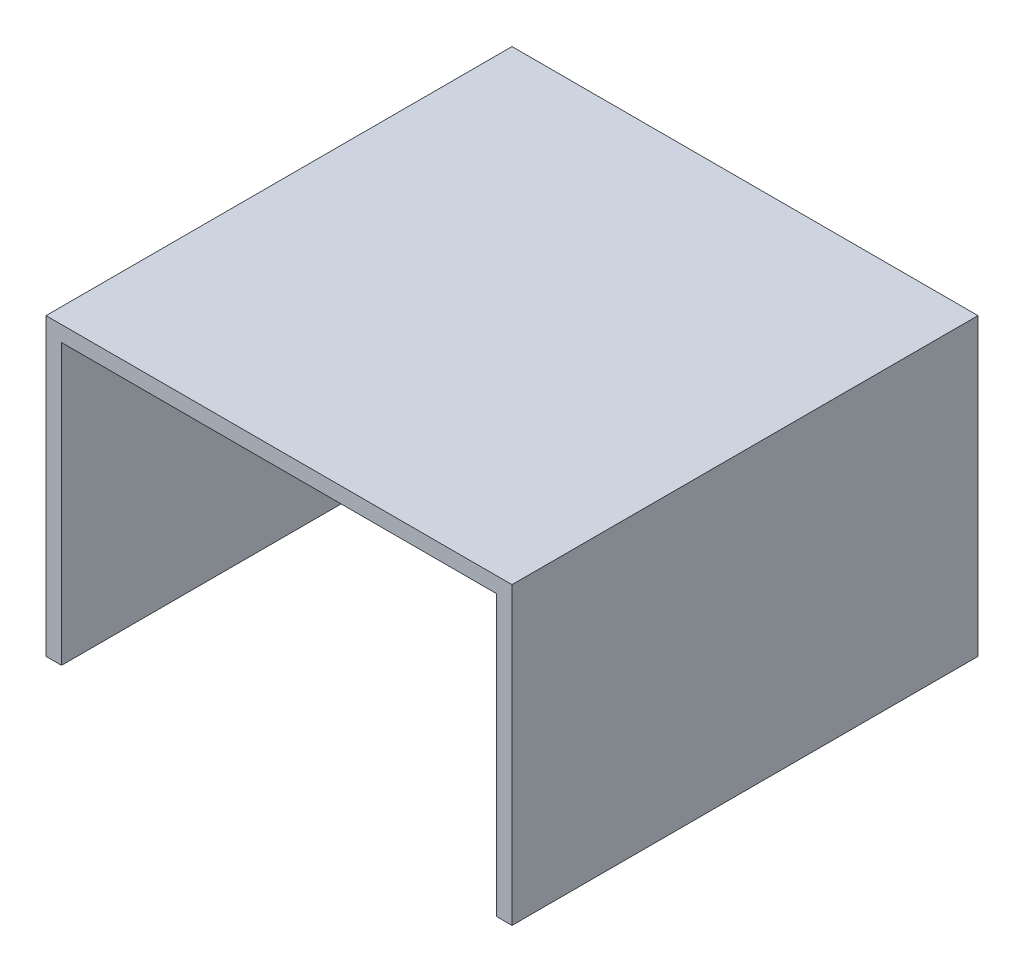
ISO-10303-21;
HEADER;
FILE_DESCRIPTION(('STEP AP214'),'2;1');
FILE_NAME('part.step','',(''),(''),'','','');
FILE_SCHEMA(('AUTOMOTIVE_DESIGN { 1 0 10303 214 1 1 1 1 }'));
ENDSEC;
DATA;
#1=APPLICATION_CONTEXT('core data for automotive mechanical design processes');
#2=APPLICATION_PROTOCOL_DEFINITION('international standard','automotive_design',2000,#1);
#3=PRODUCT_CONTEXT('',#1,'mechanical');
#4=PRODUCT('Part','Part','',(#3));
#5=PRODUCT_RELATED_PRODUCT_CATEGORY('part','',(#4));
#6=PRODUCT_DEFINITION_FORMATION('','',#4);
#7=PRODUCT_DEFINITION_CONTEXT('part definition',#1,'design');
#8=PRODUCT_DEFINITION('design','',#6,#7);
#9=PRODUCT_DEFINITION_SHAPE('','',#8);
#10=(LENGTH_UNIT() NAMED_UNIT(*) SI_UNIT(.MILLI.,.METRE.));
#11=(NAMED_UNIT(*) PLANE_ANGLE_UNIT() SI_UNIT($,.RADIAN.));
#12=(NAMED_UNIT(*) SI_UNIT($,.STERADIAN.) SOLID_ANGLE_UNIT());
#13=UNCERTAINTY_MEASURE_WITH_UNIT(LENGTH_MEASURE(1.E-05),#10,'distance_accuracy_value','');
#14=(GEOMETRIC_REPRESENTATION_CONTEXT(3) GLOBAL_UNCERTAINTY_ASSIGNED_CONTEXT((#13)) GLOBAL_UNIT_ASSIGNED_CONTEXT((#10,
#11,#12)) REPRESENTATION_CONTEXT('',''));
#15=CARTESIAN_POINT('',(0.,0.,0.));
#16=DIRECTION('',(0.,0.,1.));
#17=DIRECTION('',(1.,0.,0.));
#18=AXIS2_PLACEMENT_3D('',#15,#16,#17);
#19=CARTESIAN_POINT('',(0.,0.,0.));
#20=DIRECTION('',(0.,1.,0.));
#21=DIRECTION('',(0.,0.,1.));
#22=AXIS2_PLACEMENT_3D('',#19,#20,#21);
#23=PLANE('',#22);
#24=DIRECTION('',(0.,0.,1.));
#25=VECTOR('',#24,1.);
#26=CARTESIAN_POINT('',(-23.028710668016,0.,46.3302752293578));
#27=LINE('',#26,#25);
#28=CARTESIAN_POINT('',(-23.028710668016,0.,-13.6697247706422));
#29=VERTEX_POINT('',#28);
#30=CARTESIAN_POINT('',(-23.028710668016,0.,46.3302752293578));
#31=VERTEX_POINT('',#30);
#32=EDGE_CURVE('E132',#29,#31,#27,.T.);
#33=ORIENTED_EDGE('',*,*,#32,.F.);
#34=DIRECTION('',(-1.,0.,0.));
#35=VECTOR('',#34,1.);
#36=CARTESIAN_POINT('',(-25.028710668016,0.,-13.6697247706422));
#37=LINE('',#36,#35);
#38=CARTESIAN_POINT('',(32.971289331984,0.,-13.6697247706422));
#39=VERTEX_POINT('',#38);
#40=EDGE_CURVE('E175',#39,#29,#37,.T.);
#41=ORIENTED_EDGE('',*,*,#40,.F.);
#42=DIRECTION('',(0.,0.,-1.));
#43=VECTOR('',#42,1.);
#44=CARTESIAN_POINT('',(32.971289331984,0.,46.3302752293578));
#45=LINE('',#44,#43);
#46=CARTESIAN_POINT('',(32.971289331984,0.,46.3302752293578));
#47=VERTEX_POINT('',#46);
#48=EDGE_CURVE('E146',#47,#39,#45,.T.);
#49=ORIENTED_EDGE('',*,*,#48,.F.);
#50=DIRECTION('',(1.,0.,0.));
#51=VECTOR('',#50,1.);
#52=CARTESIAN_POINT('',(-25.028710668016,0.,46.3302752293578));
#53=LINE('',#52,#51);
#54=EDGE_CURVE('E55',#31,#47,#53,.T.);
#55=ORIENTED_EDGE('',*,*,#54,.F.);
#56=EDGE_LOOP('',(#33,#41,#49,#55));
#57=FACE_BOUND('',#56,.T.);
#58=ADVANCED_FACE('F39',(#57),#23,.F.);
#59=CARTESIAN_POINT('',(-25.028710668016,2.,-13.6697247706422));
#60=DIRECTION('',(1.,0.,0.));
#61=DIRECTION('',(0.,0.,-1.));
#62=AXIS2_PLACEMENT_3D('',#59,#60,#61);
#63=PLANE('',#62);
#64=DIRECTION('',(0.,-1.,0.));
#65=VECTOR('',#64,1.);
#66=CARTESIAN_POINT('',(-25.028710668016,2.,-13.6697247706422));
#67=LINE('',#66,#65);
#68=CARTESIAN_POINT('',(-25.028710668016,2.,-13.6697247706422));
#69=VERTEX_POINT('',#68);
#70=CARTESIAN_POINT('',(-25.028710668016,-36.,-13.6697247706422));
#71=VERTEX_POINT('',#70);
#72=EDGE_CURVE('E107',#69,#71,#67,.T.);
#73=ORIENTED_EDGE('',*,*,#72,.T.);
#74=DIRECTION('',(0.,0.,-1.));
#75=VECTOR('',#74,1.);
#76=CARTESIAN_POINT('',(-25.028710668016,-36.,46.3302752293578));
#77=LINE('',#76,#75);
#78=CARTESIAN_POINT('',(-25.028710668016,-36.,46.3302752293578));
#79=VERTEX_POINT('',#78);
#80=EDGE_CURVE('E111',#79,#71,#77,.T.);
#81=ORIENTED_EDGE('',*,*,#80,.F.);
#82=DIRECTION('',(0.,-1.,0.));
#83=VECTOR('',#82,1.);
#84=CARTESIAN_POINT('',(-25.028710668016,2.,46.3302752293578));
#85=LINE('',#84,#83);
#86=CARTESIAN_POINT('',(-25.028710668016,2.,46.3302752293578));
#87=VERTEX_POINT('',#86);
#88=EDGE_CURVE('E11',#87,#79,#85,.T.);
#89=ORIENTED_EDGE('',*,*,#88,.F.);
#90=DIRECTION('',(0.,0.,1.));
#91=VECTOR('',#90,1.);
#92=CARTESIAN_POINT('',(-25.028710668016,2.,-13.6697247706422));
#93=LINE('',#92,#91);
#94=EDGE_CURVE('E112',#69,#87,#93,.T.);
#95=ORIENTED_EDGE('',*,*,#94,.F.);
#96=EDGE_LOOP('',(#73,#81,#89,#95));
#97=FACE_BOUND('',#96,.T.);
#98=ADVANCED_FACE('F41',(#97),#63,.F.);
#99=CARTESIAN_POINT('',(-25.028710668016,2.,46.3302752293578));
#100=DIRECTION('',(0.,0.,-1.));
#101=DIRECTION('',(-1.,0.,0.));
#102=AXIS2_PLACEMENT_3D('',#99,#100,#101);
#103=PLANE('',#102);
#104=ORIENTED_EDGE('',*,*,#88,.T.);
#105=DIRECTION('',(-1.,0.,0.));
#106=VECTOR('',#105,1.);
#107=CARTESIAN_POINT('',(-25.028710668016,-36.,46.3302752293578));
#108=LINE('',#107,#106);
#109=CARTESIAN_POINT('',(-23.028710668016,-36.,46.3302752293578));
#110=VERTEX_POINT('',#109);
#111=EDGE_CURVE('E130',#110,#79,#108,.T.);
#112=ORIENTED_EDGE('',*,*,#111,.F.);
#113=DIRECTION('',(0.,1.,0.));
#114=VECTOR('',#113,1.);
#115=CARTESIAN_POINT('',(-23.028710668016,-36.,46.3302752293578));
#116=LINE('',#115,#114);
#117=EDGE_CURVE('E140',#110,#31,#116,.T.);
#118=ORIENTED_EDGE('',*,*,#117,.T.);
#119=ORIENTED_EDGE('',*,*,#54,.T.);
#120=DIRECTION('',(0.,1.,0.));
#121=VECTOR('',#120,1.);
#122=CARTESIAN_POINT('',(32.971289331984,-36.,46.3302752293578));
#123=LINE('',#122,#121);
#124=CARTESIAN_POINT('',(32.971289331984,-36.,46.3302752293578));
#125=VERTEX_POINT('',#124);
#126=EDGE_CURVE('E168',#125,#47,#123,.T.);
#127=ORIENTED_EDGE('',*,*,#126,.F.);
#128=DIRECTION('',(-1.,0.,0.));
#129=VECTOR('',#128,1.);
#130=CARTESIAN_POINT('',(34.971289331984,-36.,46.3302752293578));
#131=LINE('',#130,#129);
#132=CARTESIAN_POINT('',(34.971289331984,-36.,46.3302752293578));
#133=VERTEX_POINT('',#132);
#134=EDGE_CURVE('E151',#133,#125,#131,.T.);
#135=ORIENTED_EDGE('',*,*,#134,.F.);
#136=DIRECTION('',(0.,-1.,0.));
#137=VECTOR('',#136,1.);
#138=CARTESIAN_POINT('',(34.971289331984,2.,46.3302752293578));
#139=LINE('',#138,#137);
#140=CARTESIAN_POINT('',(34.971289331984,2.,46.3302752293578));
#141=VERTEX_POINT('',#140);
#142=EDGE_CURVE('E48',#141,#133,#139,.T.);
#143=ORIENTED_EDGE('',*,*,#142,.F.);
#144=DIRECTION('',(1.,0.,0.));
#145=VECTOR('',#144,1.);
#146=CARTESIAN_POINT('',(-25.028710668016,2.,46.3302752293578));
#147=LINE('',#146,#145);
#148=EDGE_CURVE('E174',#87,#141,#147,.T.);
#149=ORIENTED_EDGE('',*,*,#148,.F.);
#150=EDGE_LOOP('',(#104,#112,#118,#119,#127,#135,#143,#149));
#151=FACE_BOUND('',#150,.T.);
#152=ADVANCED_FACE('F196',(#151),#103,.F.);
#153=CARTESIAN_POINT('',(34.971289331984,2.,-13.6697247706422));
#154=DIRECTION('',(-1.,0.,0.));
#155=DIRECTION('',(0.,0.,1.));
#156=AXIS2_PLACEMENT_3D('',#153,#154,#155);
#157=PLANE('',#156);
#158=ORIENTED_EDGE('',*,*,#142,.T.);
#159=DIRECTION('',(0.,0.,1.));
#160=VECTOR('',#159,1.);
#161=CARTESIAN_POINT('',(34.971289331984,-36.,46.3302752293578));
#162=LINE('',#161,#160);
#163=CARTESIAN_POINT('',(34.971289331984,-36.,-13.6697247706422));
#164=VERTEX_POINT('',#163);
#165=EDGE_CURVE('E147',#164,#133,#162,.T.);
#166=ORIENTED_EDGE('',*,*,#165,.F.);
#167=DIRECTION('',(0.,-1.,0.));
#168=VECTOR('',#167,1.);
#169=CARTESIAN_POINT('',(34.971289331984,2.,-13.6697247706422));
#170=LINE('',#169,#168);
#171=CARTESIAN_POINT('',(34.971289331984,2.,-13.6697247706422));
#172=VERTEX_POINT('',#171);
#173=EDGE_CURVE('E115',#172,#164,#170,.T.);
#174=ORIENTED_EDGE('',*,*,#173,.F.);
#175=DIRECTION('',(0.,0.,-1.));
#176=VECTOR('',#175,1.);
#177=CARTESIAN_POINT('',(34.971289331984,2.,-13.6697247706422));
#178=LINE('',#177,#176);
#179=EDGE_CURVE('E178',#141,#172,#178,.T.);
#180=ORIENTED_EDGE('',*,*,#179,.F.);
#181=EDGE_LOOP('',(#158,#166,#174,#180));
#182=FACE_BOUND('',#181,.T.);
#183=ADVANCED_FACE('F194',(#182),#157,.F.);
#184=CARTESIAN_POINT('',(-25.028710668016,2.,-13.6697247706422));
#185=DIRECTION('',(0.,0.,1.));
#186=DIRECTION('',(1.,0.,0.));
#187=AXIS2_PLACEMENT_3D('',#184,#185,#186);
#188=PLANE('',#187);
#189=ORIENTED_EDGE('',*,*,#173,.T.);
#190=DIRECTION('',(1.,0.,0.));
#191=VECTOR('',#190,1.);
#192=CARTESIAN_POINT('',(34.971289331984,-36.,-13.6697247706422));
#193=LINE('',#192,#191);
#194=CARTESIAN_POINT('',(32.971289331984,-36.,-13.6697247706422));
#195=VERTEX_POINT('',#194);
#196=EDGE_CURVE('E157',#195,#164,#193,.T.);
#197=ORIENTED_EDGE('',*,*,#196,.F.);
#198=DIRECTION('',(0.,1.,0.));
#199=VECTOR('',#198,1.);
#200=CARTESIAN_POINT('',(32.971289331984,-36.,-13.6697247706422));
#201=LINE('',#200,#199);
#202=EDGE_CURVE('E161',#195,#39,#201,.T.);
#203=ORIENTED_EDGE('',*,*,#202,.T.);
#204=ORIENTED_EDGE('',*,*,#40,.T.);
#205=DIRECTION('',(0.,1.,0.));
#206=VECTOR('',#205,1.);
#207=CARTESIAN_POINT('',(-23.028710668016,-36.,-13.6697247706422));
#208=LINE('',#207,#206);
#209=CARTESIAN_POINT('',(-23.028710668016,-36.,-13.6697247706422));
#210=VERTEX_POINT('',#209);
#211=EDGE_CURVE('E121',#210,#29,#208,.T.);
#212=ORIENTED_EDGE('',*,*,#211,.F.);
#213=DIRECTION('',(1.,0.,0.));
#214=VECTOR('',#213,1.);
#215=CARTESIAN_POINT('',(-25.028710668016,-36.,-13.6697247706422));
#216=LINE('',#215,#214);
#217=EDGE_CURVE('E118',#71,#210,#216,.T.);
#218=ORIENTED_EDGE('',*,*,#217,.F.);
#219=ORIENTED_EDGE('',*,*,#72,.F.);
#220=DIRECTION('',(-1.,0.,0.));
#221=VECTOR('',#220,1.);
#222=CARTESIAN_POINT('',(-25.028710668016,2.,-13.6697247706422));
#223=LINE('',#222,#221);
#224=EDGE_CURVE('E63',#172,#69,#223,.T.);
#225=ORIENTED_EDGE('',*,*,#224,.F.);
#226=EDGE_LOOP('',(#189,#197,#203,#204,#212,#218,#219,#225));
#227=FACE_BOUND('',#226,.T.);
#228=ADVANCED_FACE('F119',(#227),#188,.F.);
#229=CARTESIAN_POINT('',(0.,2.,0.));
#230=DIRECTION('',(0.,1.,0.));
#231=DIRECTION('',(0.,0.,1.));
#232=AXIS2_PLACEMENT_3D('',#229,#230,#231);
#233=PLANE('',#232);
#234=ORIENTED_EDGE('',*,*,#94,.T.);
#235=ORIENTED_EDGE('',*,*,#148,.T.);
#236=ORIENTED_EDGE('',*,*,#179,.T.);
#237=ORIENTED_EDGE('',*,*,#224,.T.);
#238=EDGE_LOOP('',(#234,#235,#236,#237));
#239=FACE_BOUND('',#238,.T.);
#240=ADVANCED_FACE('F209',(#239),#233,.T.);
#241=CARTESIAN_POINT('',(32.971289331984,-36.,46.3302752293578));
#242=DIRECTION('',(1.,0.,0.));
#243=DIRECTION('',(0.,0.,-1.));
#244=AXIS2_PLACEMENT_3D('',#241,#242,#243);
#245=PLANE('',#244);
#246=ORIENTED_EDGE('',*,*,#48,.T.);
#247=ORIENTED_EDGE('',*,*,#202,.F.);
#248=DIRECTION('',(0.,0.,-1.));
#249=VECTOR('',#248,1.);
#250=CARTESIAN_POINT('',(32.971289331984,-36.,46.3302752293578));
#251=LINE('',#250,#249);
#252=EDGE_CURVE('E154',#125,#195,#251,.T.);
#253=ORIENTED_EDGE('',*,*,#252,.F.);
#254=ORIENTED_EDGE('',*,*,#126,.T.);
#255=EDGE_LOOP('',(#246,#247,#253,#254));
#256=FACE_BOUND('',#255,.T.);
#257=ADVANCED_FACE('F203',(#256),#245,.F.);
#258=CARTESIAN_POINT('',(0.,-36.,0.));
#259=DIRECTION('',(0.,1.,0.));
#260=DIRECTION('',(0.,0.,1.));
#261=AXIS2_PLACEMENT_3D('',#258,#259,#260);
#262=PLANE('',#261);
#263=ORIENTED_EDGE('',*,*,#165,.T.);
#264=ORIENTED_EDGE('',*,*,#134,.T.);
#265=ORIENTED_EDGE('',*,*,#252,.T.);
#266=ORIENTED_EDGE('',*,*,#196,.T.);
#267=EDGE_LOOP('',(#263,#264,#265,#266));
#268=FACE_BOUND('',#267,.T.);
#269=ADVANCED_FACE('F199',(#268),#262,.F.);
#270=CARTESIAN_POINT('',(-23.028710668016,-36.,46.3302752293578));
#271=DIRECTION('',(-1.,0.,0.));
#272=DIRECTION('',(0.,0.,1.));
#273=AXIS2_PLACEMENT_3D('',#270,#271,#272);
#274=PLANE('',#273);
#275=ORIENTED_EDGE('',*,*,#32,.T.);
#276=ORIENTED_EDGE('',*,*,#117,.F.);
#277=DIRECTION('',(0.,0.,1.));
#278=VECTOR('',#277,1.);
#279=CARTESIAN_POINT('',(-23.028710668016,-36.,46.3302752293578));
#280=LINE('',#279,#278);
#281=EDGE_CURVE('E125',#210,#110,#280,.T.);
#282=ORIENTED_EDGE('',*,*,#281,.F.);
#283=ORIENTED_EDGE('',*,*,#211,.T.);
#284=EDGE_LOOP('',(#275,#276,#282,#283));
#285=FACE_BOUND('',#284,.T.);
#286=ADVANCED_FACE('F208',(#285),#274,.F.);
#287=CARTESIAN_POINT('',(0.,-36.,0.));
#288=DIRECTION('',(0.,-1.,0.));
#289=DIRECTION('',(0.,0.,-1.));
#290=AXIS2_PLACEMENT_3D('',#287,#288,#289);
#291=PLANE('',#290);
#292=ORIENTED_EDGE('',*,*,#80,.T.);
#293=ORIENTED_EDGE('',*,*,#217,.T.);
#294=ORIENTED_EDGE('',*,*,#281,.T.);
#295=ORIENTED_EDGE('',*,*,#111,.T.);
#296=EDGE_LOOP('',(#292,#293,#294,#295));
#297=FACE_BOUND('',#296,.T.);
#298=ADVANCED_FACE('F128',(#297),#291,.T.);
#299=CLOSED_SHELL('',(#58,#98,#152,#183,#228,#240,#257,#269,#286,#298));
#300=MANIFOLD_SOLID_BREP('B2',#299);
#301=ADVANCED_BREP_SHAPE_REPRESENTATION('',(#18,#300),#14);
#302=SHAPE_DEFINITION_REPRESENTATION(#9,#301);
ENDSEC;
END-ISO-10303-21;
